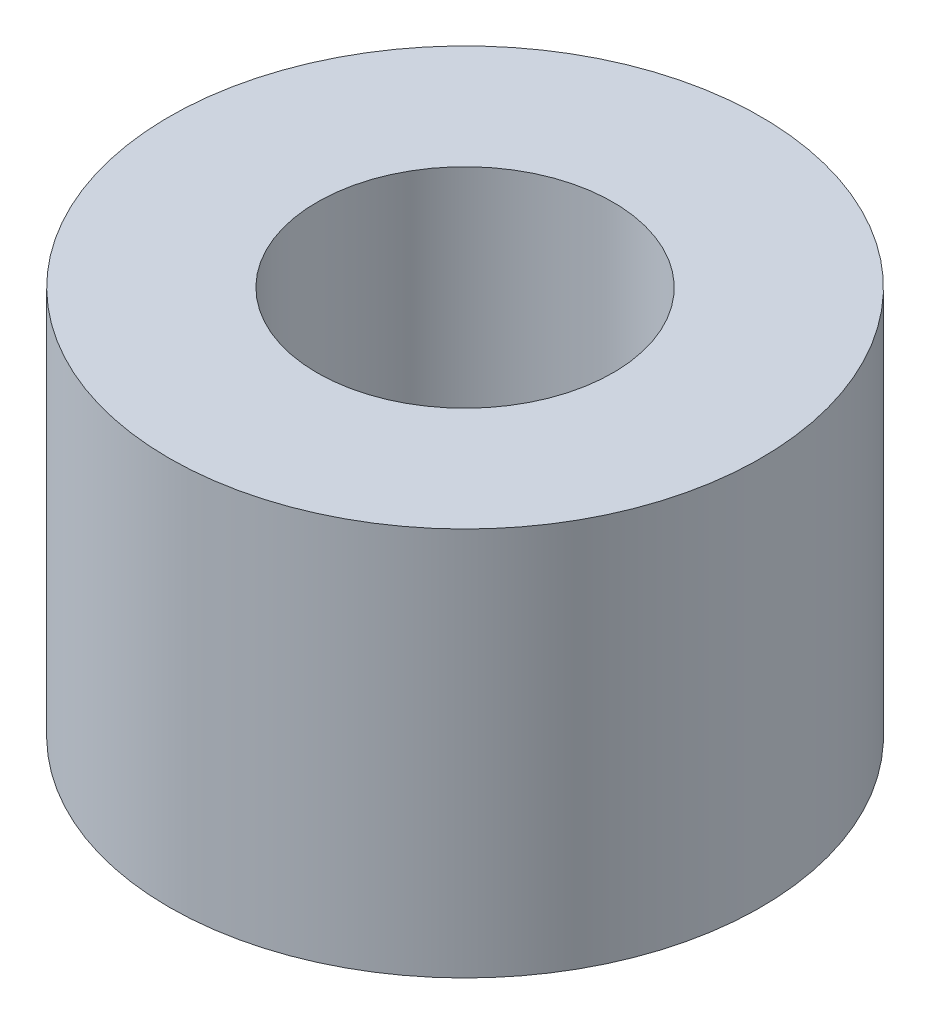
ISO-10303-21;
HEADER;
FILE_DESCRIPTION(('STEP AP214'),'2;1');
FILE_NAME('part.step','',(''),(''),'','','');
FILE_SCHEMA(('AUTOMOTIVE_DESIGN { 1 0 10303 214 1 1 1 1 }'));
ENDSEC;
DATA;
#1=APPLICATION_CONTEXT('core data for automotive mechanical design processes');
#2=APPLICATION_PROTOCOL_DEFINITION('international standard','automotive_design',2000,#1);
#3=PRODUCT_CONTEXT('',#1,'mechanical');
#4=PRODUCT('Part','Part','',(#3));
#5=PRODUCT_RELATED_PRODUCT_CATEGORY('part','',(#4));
#6=PRODUCT_DEFINITION_FORMATION('','',#4);
#7=PRODUCT_DEFINITION_CONTEXT('part definition',#1,'design');
#8=PRODUCT_DEFINITION('design','',#6,#7);
#9=PRODUCT_DEFINITION_SHAPE('','',#8);
#10=(LENGTH_UNIT() NAMED_UNIT(*) SI_UNIT(.MILLI.,.METRE.));
#11=(NAMED_UNIT(*) PLANE_ANGLE_UNIT() SI_UNIT($,.RADIAN.));
#12=(NAMED_UNIT(*) SI_UNIT($,.STERADIAN.) SOLID_ANGLE_UNIT());
#13=UNCERTAINTY_MEASURE_WITH_UNIT(LENGTH_MEASURE(1.E-05),#10,'distance_accuracy_value','');
#14=(GEOMETRIC_REPRESENTATION_CONTEXT(3) GLOBAL_UNCERTAINTY_ASSIGNED_CONTEXT((#13)) GLOBAL_UNIT_ASSIGNED_CONTEXT((#10,
#11,#12)) REPRESENTATION_CONTEXT('',''));
#15=CARTESIAN_POINT('',(0.,0.,0.));
#16=DIRECTION('',(0.,0.,1.));
#17=DIRECTION('',(1.,0.,0.));
#18=AXIS2_PLACEMENT_3D('',#15,#16,#17);
#19=CARTESIAN_POINT('',(0.,4.6,0.));
#20=DIRECTION('',(0.,1.,0.));
#21=DIRECTION('',(0.,0.,1.));
#22=AXIS2_PLACEMENT_3D('',#19,#20,#21);
#23=PLANE('',#22);
#24=CARTESIAN_POINT('',(0.,4.6,0.));
#25=DIRECTION('',(0.,1.,0.));
#26=DIRECTION('',(0.,0.,1.));
#27=AXIS2_PLACEMENT_3D('',#24,#25,#26);
#28=CIRCLE('',#27,3.5);
#29=CARTESIAN_POINT('',(0.,4.6,3.5));
#30=VERTEX_POINT('',#29);
#31=EDGE_CURVE('E10',#30,#30,#28,.T.);
#32=ORIENTED_EDGE('',*,*,#31,.T.);
#33=EDGE_LOOP('',(#32));
#34=FACE_BOUND('',#33,.T.);
#35=CARTESIAN_POINT('',(0.,4.6,0.));
#36=DIRECTION('',(0.,1.,0.));
#37=DIRECTION('',(0.,0.,1.));
#38=AXIS2_PLACEMENT_3D('',#35,#36,#37);
#39=CIRCLE('',#38,1.75);
#40=CARTESIAN_POINT('',(0.,4.6,1.75));
#41=VERTEX_POINT('',#40);
#42=EDGE_CURVE('E42',#41,#41,#39,.T.);
#43=ORIENTED_EDGE('',*,*,#42,.F.);
#44=EDGE_LOOP('',(#43));
#45=FACE_BOUND('',#44,.T.);
#46=ADVANCED_FACE('F31',(#34,#45),#23,.T.);
#47=CARTESIAN_POINT('',(0.,0.,0.));
#48=DIRECTION('',(0.,1.,0.));
#49=DIRECTION('',(0.,0.,1.));
#50=AXIS2_PLACEMENT_3D('',#47,#48,#49);
#51=PLANE('',#50);
#52=CARTESIAN_POINT('',(0.,0.,0.));
#53=DIRECTION('',(0.,1.,0.));
#54=DIRECTION('',(0.,0.,1.));
#55=AXIS2_PLACEMENT_3D('',#52,#53,#54);
#56=CIRCLE('',#55,3.5);
#57=CARTESIAN_POINT('',(0.,0.,3.5));
#58=VERTEX_POINT('',#57);
#59=EDGE_CURVE('E35',#58,#58,#56,.T.);
#60=ORIENTED_EDGE('',*,*,#59,.F.);
#61=EDGE_LOOP('',(#60));
#62=FACE_BOUND('',#61,.T.);
#63=CARTESIAN_POINT('',(0.,0.,0.));
#64=DIRECTION('',(0.,1.,0.));
#65=DIRECTION('',(0.,0.,1.));
#66=AXIS2_PLACEMENT_3D('',#63,#64,#65);
#67=CIRCLE('',#66,1.75);
#68=CARTESIAN_POINT('',(0.,0.,1.75));
#69=VERTEX_POINT('',#68);
#70=EDGE_CURVE('E44',#69,#69,#67,.T.);
#71=ORIENTED_EDGE('',*,*,#70,.T.);
#72=EDGE_LOOP('',(#71));
#73=FACE_BOUND('',#72,.T.);
#74=ADVANCED_FACE('F54',(#62,#73),#51,.F.);
#75=CARTESIAN_POINT('',(0.,4.6,0.));
#76=DIRECTION('',(0.,-1.,0.));
#77=DIRECTION('',(0.,0.,-1.));
#78=AXIS2_PLACEMENT_3D('',#75,#76,#77);
#79=CYLINDRICAL_SURFACE('',#78,3.5);
#80=ORIENTED_EDGE('',*,*,#31,.F.);
#81=EDGE_LOOP('',(#80));
#82=FACE_BOUND('',#81,.T.);
#83=ORIENTED_EDGE('',*,*,#59,.T.);
#84=EDGE_LOOP('',(#83));
#85=FACE_BOUND('',#84,.T.);
#86=ADVANCED_FACE('F33',(#82,#85),#79,.T.);
#87=CARTESIAN_POINT('',(0.,4.6,0.));
#88=DIRECTION('',(0.,-1.,0.));
#89=DIRECTION('',(0.,0.,-1.));
#90=AXIS2_PLACEMENT_3D('',#87,#88,#89);
#91=CYLINDRICAL_SURFACE('',#90,1.75);
#92=ORIENTED_EDGE('',*,*,#42,.T.);
#93=EDGE_LOOP('',(#92));
#94=FACE_BOUND('',#93,.T.);
#95=ORIENTED_EDGE('',*,*,#70,.F.);
#96=EDGE_LOOP('',(#95));
#97=FACE_BOUND('',#96,.T.);
#98=ADVANCED_FACE('F50',(#94,#97),#91,.F.);
#99=CLOSED_SHELL('',(#46,#74,#86,#98));
#100=MANIFOLD_SOLID_BREP('B2',#99);
#101=ADVANCED_BREP_SHAPE_REPRESENTATION('',(#18,#100),#14);
#102=SHAPE_DEFINITION_REPRESENTATION(#9,#101);
ENDSEC;
END-ISO-10303-21;
